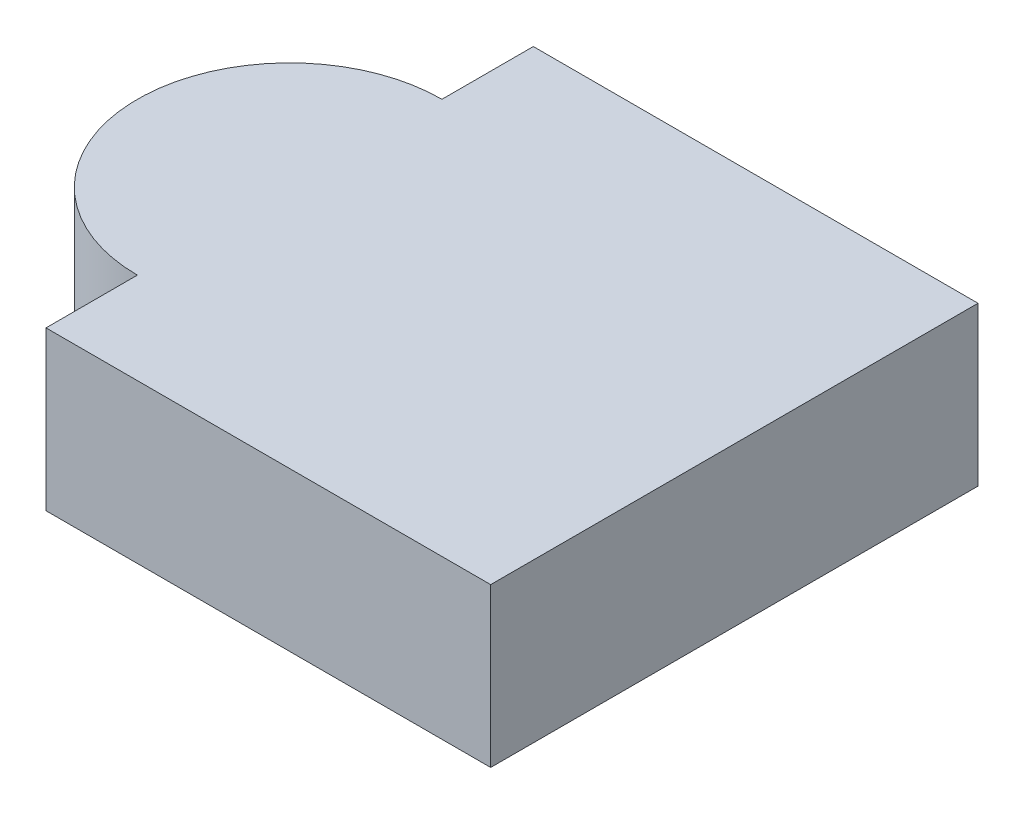
ISO-10303-21;
HEADER;
FILE_DESCRIPTION(('STEP AP214'),'2;1');
FILE_NAME('part.step','',(''),(''),'','','');
FILE_SCHEMA(('AUTOMOTIVE_DESIGN { 1 0 10303 214 1 1 1 1 }'));
ENDSEC;
DATA;
#1=APPLICATION_CONTEXT('core data for automotive mechanical design processes');
#2=APPLICATION_PROTOCOL_DEFINITION('international standard','automotive_design',2000,#1);
#3=PRODUCT_CONTEXT('',#1,'mechanical');
#4=PRODUCT('Part','Part','',(#3));
#5=PRODUCT_RELATED_PRODUCT_CATEGORY('part','',(#4));
#6=PRODUCT_DEFINITION_FORMATION('','',#4);
#7=PRODUCT_DEFINITION_CONTEXT('part definition',#1,'design');
#8=PRODUCT_DEFINITION('design','',#6,#7);
#9=PRODUCT_DEFINITION_SHAPE('','',#8);
#10=(LENGTH_UNIT() NAMED_UNIT(*) SI_UNIT(.MILLI.,.METRE.));
#11=(NAMED_UNIT(*) PLANE_ANGLE_UNIT() SI_UNIT($,.RADIAN.));
#12=(NAMED_UNIT(*) SI_UNIT($,.STERADIAN.) SOLID_ANGLE_UNIT());
#13=UNCERTAINTY_MEASURE_WITH_UNIT(LENGTH_MEASURE(1.E-05),#10,'distance_accuracy_value','');
#14=(GEOMETRIC_REPRESENTATION_CONTEXT(3) GLOBAL_UNCERTAINTY_ASSIGNED_CONTEXT((#13)) GLOBAL_UNIT_ASSIGNED_CONTEXT((#10,
#11,#12)) REPRESENTATION_CONTEXT('',''));
#15=CARTESIAN_POINT('',(0.,0.,0.));
#16=DIRECTION('',(0.,0.,1.));
#17=DIRECTION('',(1.,0.,0.));
#18=AXIS2_PLACEMENT_3D('',#15,#16,#17);
#19=CARTESIAN_POINT('',(0.,0.13,0.));
#20=DIRECTION('',(0.,1.,0.));
#21=DIRECTION('',(0.,0.,1.));
#22=AXIS2_PLACEMENT_3D('',#19,#20,#21);
#23=PLANE('',#22);
#24=DIRECTION('',(-1.,0.,0.));
#25=VECTOR('',#24,1.);
#26=CARTESIAN_POINT('',(0.,0.13,-0.2));
#27=LINE('',#26,#25);
#28=CARTESIAN_POINT('',(0.1825,0.13,-0.2));
#29=VERTEX_POINT('',#28);
#30=CARTESIAN_POINT('',(-0.1825,0.13,-0.2));
#31=VERTEX_POINT('',#30);
#32=EDGE_CURVE('E11',#29,#31,#27,.T.);
#33=ORIENTED_EDGE('',*,*,#32,.T.);
#34=DIRECTION('',(0.,0.,1.));
#35=VECTOR('',#34,1.);
#36=CARTESIAN_POINT('',(-0.1825,0.13,0.));
#37=LINE('',#36,#35);
#38=CARTESIAN_POINT('',(-0.1825,0.13,-0.125));
#39=VERTEX_POINT('',#38);
#40=EDGE_CURVE('E25',#31,#39,#37,.T.);
#41=ORIENTED_EDGE('',*,*,#40,.T.);
#42=CARTESIAN_POINT('',(-0.1825,0.13,0.));
#43=DIRECTION('',(0.,1.,0.));
#44=DIRECTION('',(0.,0.,-1.));
#45=AXIS2_PLACEMENT_3D('',#42,#43,#44);
#46=CIRCLE('',#45,0.125);
#47=CARTESIAN_POINT('',(-0.1825,0.13,0.125));
#48=VERTEX_POINT('',#47);
#49=EDGE_CURVE('E139',#39,#48,#46,.T.);
#50=ORIENTED_EDGE('',*,*,#49,.T.);
#51=DIRECTION('',(0.,0.,1.));
#52=VECTOR('',#51,1.);
#53=CARTESIAN_POINT('',(-0.1825,0.13,0.));
#54=LINE('',#53,#52);
#55=CARTESIAN_POINT('',(-0.1825,0.13,0.2));
#56=VERTEX_POINT('',#55);
#57=EDGE_CURVE('E84',#48,#56,#54,.T.);
#58=ORIENTED_EDGE('',*,*,#57,.T.);
#59=DIRECTION('',(1.,0.,0.));
#60=VECTOR('',#59,1.);
#61=CARTESIAN_POINT('',(0.,0.13,0.2));
#62=LINE('',#61,#60);
#63=CARTESIAN_POINT('',(0.1825,0.13,0.2));
#64=VERTEX_POINT('',#63);
#65=EDGE_CURVE('E132',#56,#64,#62,.T.);
#66=ORIENTED_EDGE('',*,*,#65,.T.);
#67=DIRECTION('',(0.,0.,-1.));
#68=VECTOR('',#67,1.);
#69=CARTESIAN_POINT('',(0.1825,0.13,0.));
#70=LINE('',#69,#68);
#71=EDGE_CURVE('E128',#64,#29,#70,.T.);
#72=ORIENTED_EDGE('',*,*,#71,.T.);
#73=EDGE_LOOP('',(#33,#41,#50,#58,#66,#72));
#74=FACE_BOUND('',#73,.T.);
#75=ADVANCED_FACE('F17',(#74),#23,.T.);
#76=CARTESIAN_POINT('',(0.1825,0.13,0.));
#77=DIRECTION('',(1.,0.,0.));
#78=DIRECTION('',(0.,0.,-1.));
#79=AXIS2_PLACEMENT_3D('',#76,#77,#78);
#80=PLANE('',#79);
#81=ORIENTED_EDGE('',*,*,#71,.F.);
#82=DIRECTION('',(0.,-1.,0.));
#83=VECTOR('',#82,1.);
#84=CARTESIAN_POINT('',(0.1825,0.13,0.2));
#85=LINE('',#84,#83);
#86=CARTESIAN_POINT('',(0.1825,0.,0.2));
#87=VERTEX_POINT('',#86);
#88=EDGE_CURVE('E124',#64,#87,#85,.T.);
#89=ORIENTED_EDGE('',*,*,#88,.T.);
#90=DIRECTION('',(0.,0.,-1.));
#91=VECTOR('',#90,1.);
#92=CARTESIAN_POINT('',(0.1825,0.,0.));
#93=LINE('',#92,#91);
#94=CARTESIAN_POINT('',(0.1825,0.,-0.2));
#95=VERTEX_POINT('',#94);
#96=EDGE_CURVE('E120',#87,#95,#93,.T.);
#97=ORIENTED_EDGE('',*,*,#96,.T.);
#98=DIRECTION('',(0.,-1.,0.));
#99=VECTOR('',#98,1.);
#100=CARTESIAN_POINT('',(0.1825,0.13,-0.2));
#101=LINE('',#100,#99);
#102=EDGE_CURVE('E115',#29,#95,#101,.T.);
#103=ORIENTED_EDGE('',*,*,#102,.F.);
#104=EDGE_LOOP('',(#81,#89,#97,#103));
#105=FACE_BOUND('',#104,.T.);
#106=ADVANCED_FACE('F155',(#105),#80,.T.);
#107=CARTESIAN_POINT('',(0.,0.13,-0.2));
#108=DIRECTION('',(0.,0.,-1.));
#109=DIRECTION('',(-1.,0.,0.));
#110=AXIS2_PLACEMENT_3D('',#107,#108,#109);
#111=PLANE('',#110);
#112=ORIENTED_EDGE('',*,*,#32,.F.);
#113=ORIENTED_EDGE('',*,*,#102,.T.);
#114=DIRECTION('',(-1.,0.,0.));
#115=VECTOR('',#114,1.);
#116=CARTESIAN_POINT('',(0.,0.,-0.2));
#117=LINE('',#116,#115);
#118=CARTESIAN_POINT('',(-0.1825,0.,-0.2));
#119=VERTEX_POINT('',#118);
#120=EDGE_CURVE('E111',#95,#119,#117,.T.);
#121=ORIENTED_EDGE('',*,*,#120,.T.);
#122=DIRECTION('',(0.,1.,0.));
#123=VECTOR('',#122,1.);
#124=CARTESIAN_POINT('',(-0.1825,0.13,-0.2));
#125=LINE('',#124,#123);
#126=EDGE_CURVE('E107',#119,#31,#125,.T.);
#127=ORIENTED_EDGE('',*,*,#126,.T.);
#128=EDGE_LOOP('',(#112,#113,#121,#127));
#129=FACE_BOUND('',#128,.T.);
#130=ADVANCED_FACE('F158',(#129),#111,.T.);
#131=CARTESIAN_POINT('',(-0.1825,0.13,0.));
#132=DIRECTION('',(1.,0.,0.));
#133=DIRECTION('',(0.,0.,-1.));
#134=AXIS2_PLACEMENT_3D('',#131,#132,#133);
#135=PLANE('',#134);
#136=DIRECTION('',(0.,-1.,0.));
#137=VECTOR('',#136,1.);
#138=CARTESIAN_POINT('',(-0.1825,0.13,-0.125));
#139=LINE('',#138,#137);
#140=CARTESIAN_POINT('',(-0.1825,0.,-0.125));
#141=VERTEX_POINT('',#140);
#142=EDGE_CURVE('E90',#39,#141,#139,.T.);
#143=ORIENTED_EDGE('',*,*,#142,.F.);
#144=ORIENTED_EDGE('',*,*,#40,.F.);
#145=ORIENTED_EDGE('',*,*,#126,.F.);
#146=DIRECTION('',(0.,0.,-1.));
#147=VECTOR('',#146,1.);
#148=CARTESIAN_POINT('',(-0.1825,0.,0.));
#149=LINE('',#148,#147);
#150=EDGE_CURVE('E100',#141,#119,#149,.T.);
#151=ORIENTED_EDGE('',*,*,#150,.F.);
#152=EDGE_LOOP('',(#143,#144,#145,#151));
#153=FACE_BOUND('',#152,.T.);
#154=ADVANCED_FACE('F161',(#153),#135,.F.);
#155=CARTESIAN_POINT('',(0.,0.,0.));
#156=DIRECTION('',(0.,1.,0.));
#157=DIRECTION('',(0.,0.,1.));
#158=AXIS2_PLACEMENT_3D('',#155,#156,#157);
#159=PLANE('',#158);
#160=ORIENTED_EDGE('',*,*,#150,.T.);
#161=ORIENTED_EDGE('',*,*,#120,.F.);
#162=ORIENTED_EDGE('',*,*,#96,.F.);
#163=DIRECTION('',(-1.,0.,0.));
#164=VECTOR('',#163,1.);
#165=CARTESIAN_POINT('',(0.,0.,0.2));
#166=LINE('',#165,#164);
#167=CARTESIAN_POINT('',(-0.1825,0.,0.2));
#168=VERTEX_POINT('',#167);
#169=EDGE_CURVE('E75',#87,#168,#166,.T.);
#170=ORIENTED_EDGE('',*,*,#169,.T.);
#171=DIRECTION('',(0.,0.,-1.));
#172=VECTOR('',#171,1.);
#173=CARTESIAN_POINT('',(-0.1825,0.,0.));
#174=LINE('',#173,#172);
#175=CARTESIAN_POINT('',(-0.1825,0.,0.125));
#176=VERTEX_POINT('',#175);
#177=EDGE_CURVE('E66',#168,#176,#174,.T.);
#178=ORIENTED_EDGE('',*,*,#177,.T.);
#179=CARTESIAN_POINT('',(-0.1825,0.,0.));
#180=DIRECTION('',(0.,1.,0.));
#181=DIRECTION('',(0.,0.,-1.));
#182=AXIS2_PLACEMENT_3D('',#179,#180,#181);
#183=CIRCLE('',#182,0.125);
#184=EDGE_CURVE('E71',#141,#176,#183,.T.);
#185=ORIENTED_EDGE('',*,*,#184,.F.);
#186=EDGE_LOOP('',(#160,#161,#162,#170,#178,#185));
#187=FACE_BOUND('',#186,.T.);
#188=ADVANCED_FACE('F69',(#187),#159,.F.);
#189=CARTESIAN_POINT('',(-0.1825,0.13,0.));
#190=DIRECTION('',(0.,-1.,0.));
#191=DIRECTION('',(1.,0.,0.));
#192=AXIS2_PLACEMENT_3D('',#189,#190,#191);
#193=CYLINDRICAL_SURFACE('',#192,0.125);
#194=ORIENTED_EDGE('',*,*,#49,.F.);
#195=ORIENTED_EDGE('',*,*,#142,.T.);
#196=ORIENTED_EDGE('',*,*,#184,.T.);
#197=DIRECTION('',(0.,1.,0.));
#198=VECTOR('',#197,1.);
#199=CARTESIAN_POINT('',(-0.1825,0.13,0.125));
#200=LINE('',#199,#198);
#201=EDGE_CURVE('E82',#176,#48,#200,.T.);
#202=ORIENTED_EDGE('',*,*,#201,.T.);
#203=EDGE_LOOP('',(#194,#195,#196,#202));
#204=FACE_BOUND('',#203,.T.);
#205=ADVANCED_FACE('F89',(#204),#193,.T.);
#206=CARTESIAN_POINT('',(-0.1825,0.13,0.));
#207=DIRECTION('',(1.,0.,0.));
#208=DIRECTION('',(0.,0.,-1.));
#209=AXIS2_PLACEMENT_3D('',#206,#207,#208);
#210=PLANE('',#209);
#211=DIRECTION('',(0.,1.,0.));
#212=VECTOR('',#211,1.);
#213=CARTESIAN_POINT('',(-0.1825,0.13,0.2));
#214=LINE('',#213,#212);
#215=EDGE_CURVE('E87',#168,#56,#214,.T.);
#216=ORIENTED_EDGE('',*,*,#215,.T.);
#217=ORIENTED_EDGE('',*,*,#57,.F.);
#218=ORIENTED_EDGE('',*,*,#201,.F.);
#219=ORIENTED_EDGE('',*,*,#177,.F.);
#220=EDGE_LOOP('',(#216,#217,#218,#219));
#221=FACE_BOUND('',#220,.T.);
#222=ADVANCED_FACE('F83',(#221),#210,.F.);
#223=CARTESIAN_POINT('',(0.,0.13,0.2));
#224=DIRECTION('',(0.,0.,-1.));
#225=DIRECTION('',(-1.,0.,0.));
#226=AXIS2_PLACEMENT_3D('',#223,#224,#225);
#227=PLANE('',#226);
#228=ORIENTED_EDGE('',*,*,#88,.F.);
#229=ORIENTED_EDGE('',*,*,#65,.F.);
#230=ORIENTED_EDGE('',*,*,#215,.F.);
#231=ORIENTED_EDGE('',*,*,#169,.F.);
#232=EDGE_LOOP('',(#228,#229,#230,#231));
#233=FACE_BOUND('',#232,.T.);
#234=ADVANCED_FACE('F151',(#233),#227,.F.);
#235=CLOSED_SHELL('',(#75,#106,#130,#154,#188,#205,#222,#234));
#236=MANIFOLD_SOLID_BREP('B1',#235);
#237=ADVANCED_BREP_SHAPE_REPRESENTATION('',(#18,#236),#14);
#238=SHAPE_DEFINITION_REPRESENTATION(#9,#237);
ENDSEC;
END-ISO-10303-21;
